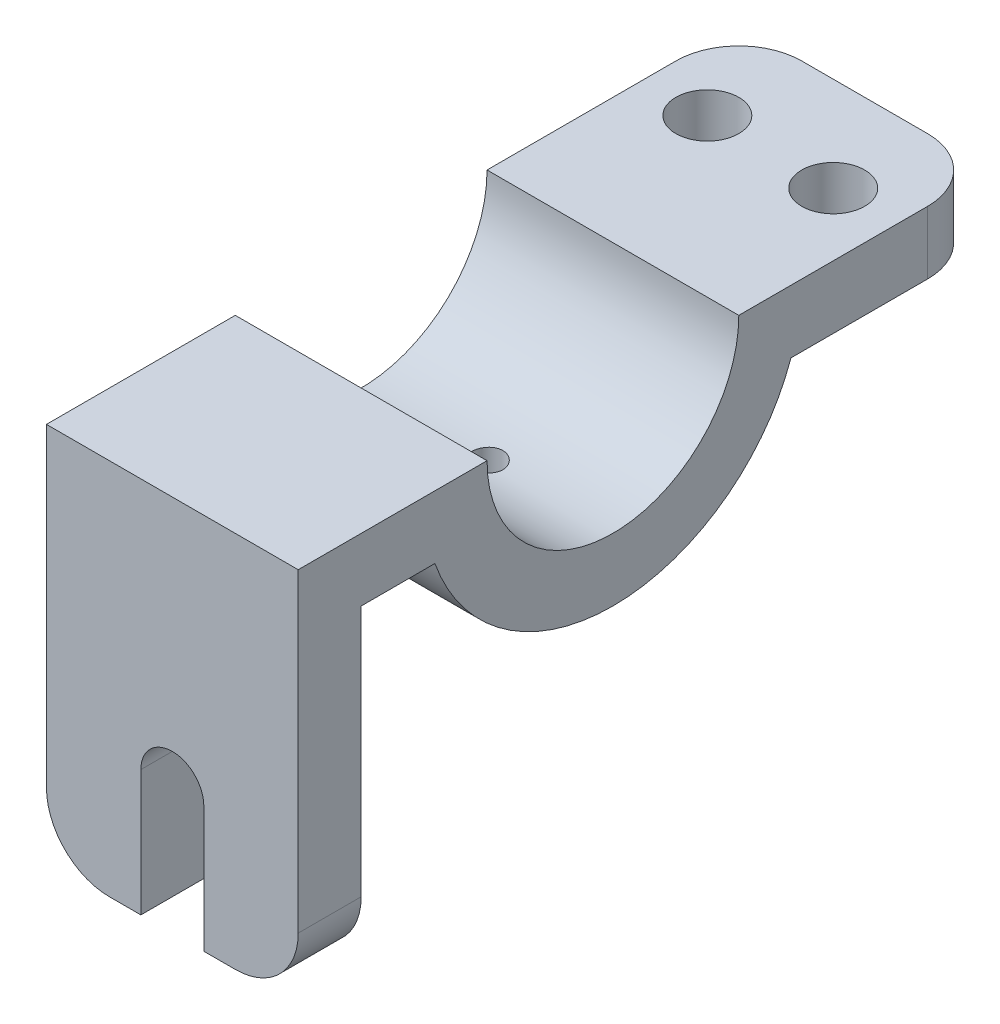
ISO-10303-21;
HEADER;
FILE_DESCRIPTION(('STEP AP214'),'2;1');
FILE_NAME('part.step','',(''),(''),'','','');
FILE_SCHEMA(('AUTOMOTIVE_DESIGN { 1 0 10303 214 1 1 1 1 }'));
ENDSEC;
DATA;
#1=APPLICATION_CONTEXT('core data for automotive mechanical design processes');
#2=APPLICATION_PROTOCOL_DEFINITION('international standard','automotive_design',2000,#1);
#3=PRODUCT_CONTEXT('',#1,'mechanical');
#4=PRODUCT('Part','Part','',(#3));
#5=PRODUCT_RELATED_PRODUCT_CATEGORY('part','',(#4));
#6=PRODUCT_DEFINITION_FORMATION('','',#4);
#7=PRODUCT_DEFINITION_CONTEXT('part definition',#1,'design');
#8=PRODUCT_DEFINITION('design','',#6,#7);
#9=PRODUCT_DEFINITION_SHAPE('','',#8);
#10=(LENGTH_UNIT() NAMED_UNIT(*) SI_UNIT(.MILLI.,.METRE.));
#11=(NAMED_UNIT(*) PLANE_ANGLE_UNIT() SI_UNIT($,.RADIAN.));
#12=(NAMED_UNIT(*) SI_UNIT($,.STERADIAN.) SOLID_ANGLE_UNIT());
#13=UNCERTAINTY_MEASURE_WITH_UNIT(LENGTH_MEASURE(1.E-05),#10,'distance_accuracy_value','');
#14=(GEOMETRIC_REPRESENTATION_CONTEXT(3) GLOBAL_UNCERTAINTY_ASSIGNED_CONTEXT((#13)) GLOBAL_UNIT_ASSIGNED_CONTEXT((#10,
#11,#12)) REPRESENTATION_CONTEXT('',''));
#15=CARTESIAN_POINT('',(0.,0.,0.));
#16=DIRECTION('',(0.,0.,1.));
#17=DIRECTION('',(1.,0.,0.));
#18=AXIS2_PLACEMENT_3D('',#15,#16,#17);
#19=CARTESIAN_POINT('',(50.8,-12.7,-139.7));
#20=DIRECTION('',(0.,0.,1.));
#21=DIRECTION('',(1.,0.,0.));
#22=AXIS2_PLACEMENT_3D('',#19,#20,#21);
#23=PLANE('',#22);
#24=DIRECTION('',(-1.,0.,0.));
#25=VECTOR('',#24,1.);
#26=CARTESIAN_POINT('',(50.8,0.,-139.7));
#27=LINE('',#26,#25);
#28=CARTESIAN_POINT('',(38.0999999999999,0.,-139.7));
#29=VERTEX_POINT('',#28);
#30=CARTESIAN_POINT('',(12.7000000000001,0.,-139.7));
#31=VERTEX_POINT('',#30);
#32=EDGE_CURVE('E220',#29,#31,#27,.T.);
#33=ORIENTED_EDGE('',*,*,#32,.F.);
#34=DIRECTION('',(0.,1.,0.));
#35=VECTOR('',#34,1.);
#36=CARTESIAN_POINT('',(38.0999999999999,-30.48,-139.7));
#37=LINE('',#36,#35);
#38=CARTESIAN_POINT('',(38.0999999999999,-12.7,-139.7));
#39=VERTEX_POINT('',#38);
#40=EDGE_CURVE('E54',#39,#29,#37,.T.);
#41=ORIENTED_EDGE('',*,*,#40,.F.);
#42=DIRECTION('',(-1.,0.,0.));
#43=VECTOR('',#42,1.);
#44=CARTESIAN_POINT('',(50.8,-12.7,-139.7));
#45=LINE('',#44,#43);
#46=CARTESIAN_POINT('',(12.7000000000001,-12.7,-139.7));
#47=VERTEX_POINT('',#46);
#48=EDGE_CURVE('E222',#39,#47,#45,.T.);
#49=ORIENTED_EDGE('',*,*,#48,.T.);
#50=DIRECTION('',(0.,1.,0.));
#51=VECTOR('',#50,1.);
#52=CARTESIAN_POINT('',(12.7000000000001,-30.48,-139.7));
#53=LINE('',#52,#51);
#54=EDGE_CURVE('E305',#47,#31,#53,.T.);
#55=ORIENTED_EDGE('',*,*,#54,.T.);
#56=EDGE_LOOP('',(#33,#41,#49,#55));
#57=FACE_BOUND('',#56,.T.);
#58=ADVANCED_FACE('F33',(#57),#23,.F.);
#59=CARTESIAN_POINT('',(50.8,-76.2,0.));
#60=DIRECTION('',(0.,1.,0.));
#61=DIRECTION('',(0.,0.,1.));
#62=AXIS2_PLACEMENT_3D('',#59,#60,#61);
#63=PLANE('',#62);
#64=DIRECTION('',(-1.,0.,0.));
#65=VECTOR('',#64,1.);
#66=CARTESIAN_POINT('',(50.8,-76.2,-12.7));
#67=LINE('',#66,#65);
#68=CARTESIAN_POINT('',(19.05,-76.2,-12.7));
#69=VERTEX_POINT('',#68);
#70=CARTESIAN_POINT('',(12.7000000000001,-76.2,-12.7));
#71=VERTEX_POINT('',#70);
#72=EDGE_CURVE('E233',#69,#71,#67,.T.);
#73=ORIENTED_EDGE('',*,*,#72,.F.);
#74=DIRECTION('',(0.,0.,1.));
#75=VECTOR('',#74,1.);
#76=CARTESIAN_POINT('',(19.05,-76.2,0.));
#77=LINE('',#76,#75);
#78=CARTESIAN_POINT('',(19.05,-76.2,0.));
#79=VERTEX_POINT('',#78);
#80=EDGE_CURVE('E47',#69,#79,#77,.T.);
#81=ORIENTED_EDGE('',*,*,#80,.T.);
#82=DIRECTION('',(-1.,0.,0.));
#83=VECTOR('',#82,1.);
#84=CARTESIAN_POINT('',(50.8,-76.2,0.));
#85=LINE('',#84,#83);
#86=CARTESIAN_POINT('',(12.7000000000001,-76.2,0.));
#87=VERTEX_POINT('',#86);
#88=EDGE_CURVE('E237',#79,#87,#85,.T.);
#89=ORIENTED_EDGE('',*,*,#88,.T.);
#90=DIRECTION('',(0.,0.,1.));
#91=VECTOR('',#90,1.);
#92=CARTESIAN_POINT('',(12.7000000000001,-76.2,-22.86));
#93=LINE('',#92,#91);
#94=EDGE_CURVE('E267',#71,#87,#93,.T.);
#95=ORIENTED_EDGE('',*,*,#94,.F.);
#96=EDGE_LOOP('',(#73,#81,#89,#95));
#97=FACE_BOUND('',#96,.T.);
#98=ADVANCED_FACE('F253',(#97),#63,.F.);
#99=CARTESIAN_POINT('',(50.8,0.,0.));
#100=DIRECTION('',(0.,0.,-1.));
#101=DIRECTION('',(0.,1.,0.));
#102=AXIS2_PLACEMENT_3D('',#99,#100,#101);
#103=PLANE('',#102);
#104=ORIENTED_EDGE('',*,*,#88,.F.);
#105=DIRECTION('',(0.,-1.,0.));
#106=VECTOR('',#105,1.);
#107=CARTESIAN_POINT('',(19.05,-76.2,0.));
#108=LINE('',#107,#106);
#109=CARTESIAN_POINT('',(19.05,-50.8,0.));
#110=VERTEX_POINT('',#109);
#111=EDGE_CURVE('E262',#110,#79,#108,.T.);
#112=ORIENTED_EDGE('',*,*,#111,.F.);
#113=CARTESIAN_POINT('',(25.4,-50.8,0.));
#114=DIRECTION('',(0.,0.,1.));
#115=DIRECTION('',(1.,0.,0.));
#116=AXIS2_PLACEMENT_3D('',#113,#114,#115);
#117=CIRCLE('',#116,6.35);
#118=CARTESIAN_POINT('',(31.75,-50.8,0.));
#119=VERTEX_POINT('',#118);
#120=EDGE_CURVE('E571',#119,#110,#117,.T.);
#121=ORIENTED_EDGE('',*,*,#120,.F.);
#122=DIRECTION('',(0.,1.,0.));
#123=VECTOR('',#122,1.);
#124=CARTESIAN_POINT('',(31.75,-50.8,0.));
#125=LINE('',#124,#123);
#126=CARTESIAN_POINT('',(31.75,-76.2,0.));
#127=VERTEX_POINT('',#126);
#128=EDGE_CURVE('E321',#127,#119,#125,.T.);
#129=ORIENTED_EDGE('',*,*,#128,.F.);
#130=CARTESIAN_POINT('',(38.0999999999999,-76.2,0.));
#131=VERTEX_POINT('',#130);
#132=EDGE_CURVE('E238',#131,#127,#85,.T.);
#133=ORIENTED_EDGE('',*,*,#132,.F.);
#134=CARTESIAN_POINT('',(38.1,-63.5,0.));
#135=DIRECTION('',(0.,0.,-1.));
#136=DIRECTION('',(1.,0.,0.));
#137=AXIS2_PLACEMENT_3D('',#134,#135,#136);
#138=CIRCLE('',#137,12.7);
#139=CARTESIAN_POINT('',(50.8,-63.4999999999999,0.));
#140=VERTEX_POINT('',#139);
#141=EDGE_CURVE('E278',#140,#131,#138,.T.);
#142=ORIENTED_EDGE('',*,*,#141,.F.);
#143=DIRECTION('',(0.,-1.,0.));
#144=VECTOR('',#143,1.);
#145=CARTESIAN_POINT('',(50.8,0.,0.));
#146=LINE('',#145,#144);
#147=CARTESIAN_POINT('',(50.8,0.,0.));
#148=VERTEX_POINT('',#147);
#149=EDGE_CURVE('E213',#148,#140,#146,.T.);
#150=ORIENTED_EDGE('',*,*,#149,.F.);
#151=DIRECTION('',(-1.,0.,0.));
#152=VECTOR('',#151,1.);
#153=CARTESIAN_POINT('',(50.8,0.,0.));
#154=LINE('',#153,#152);
#155=CARTESIAN_POINT('',(0.,0.,0.));
#156=VERTEX_POINT('',#155);
#157=EDGE_CURVE('E193',#148,#156,#154,.T.);
#158=ORIENTED_EDGE('',*,*,#157,.T.);
#159=DIRECTION('',(0.,-1.,0.));
#160=VECTOR('',#159,1.);
#161=CARTESIAN_POINT('',(0.,0.,0.));
#162=LINE('',#161,#160);
#163=CARTESIAN_POINT('',(0.,-63.4999999999999,0.));
#164=VERTEX_POINT('',#163);
#165=EDGE_CURVE('E194',#156,#164,#162,.T.);
#166=ORIENTED_EDGE('',*,*,#165,.T.);
#167=CARTESIAN_POINT('',(12.7,-63.5,0.));
#168=DIRECTION('',(0.,0.,-1.));
#169=DIRECTION('',(1.,0.,0.));
#170=AXIS2_PLACEMENT_3D('',#167,#168,#169);
#171=CIRCLE('',#170,12.7);
#172=EDGE_CURVE('E263',#87,#164,#171,.T.);
#173=ORIENTED_EDGE('',*,*,#172,.F.);
#174=EDGE_LOOP('',(#104,#112,#121,#129,#133,#142,#150,#158,#166,#173));
#175=FACE_BOUND('',#174,.T.);
#176=ADVANCED_FACE('F35',(#175),#103,.F.);
#177=CARTESIAN_POINT('',(50.8,-76.2,-12.7));
#178=DIRECTION('',(0.,0.,1.));
#179=DIRECTION('',(1.,0.,0.));
#180=AXIS2_PLACEMENT_3D('',#177,#178,#179);
#181=PLANE('',#180);
#182=CARTESIAN_POINT('',(25.4,-50.8,-12.7));
#183=DIRECTION('',(0.,0.,1.));
#184=DIRECTION('',(1.,0.,0.));
#185=AXIS2_PLACEMENT_3D('',#182,#183,#184);
#186=CIRCLE('',#185,6.35);
#187=CARTESIAN_POINT('',(31.75,-50.8,-12.7));
#188=VERTEX_POINT('',#187);
#189=CARTESIAN_POINT('',(19.05,-50.8,-12.7));
#190=VERTEX_POINT('',#189);
#191=EDGE_CURVE('E11',#188,#190,#186,.T.);
#192=ORIENTED_EDGE('',*,*,#191,.T.);
#193=DIRECTION('',(0.,-1.,0.));
#194=VECTOR('',#193,1.);
#195=CARTESIAN_POINT('',(19.05,-76.2,-12.7));
#196=LINE('',#195,#194);
#197=EDGE_CURVE('E268',#190,#69,#196,.T.);
#198=ORIENTED_EDGE('',*,*,#197,.T.);
#199=ORIENTED_EDGE('',*,*,#72,.T.);
#200=CARTESIAN_POINT('',(12.7,-63.5,-12.7));
#201=DIRECTION('',(0.,0.,1.));
#202=DIRECTION('',(1.,0.,0.));
#203=AXIS2_PLACEMENT_3D('',#200,#201,#202);
#204=CIRCLE('',#203,12.7);
#205=CARTESIAN_POINT('',(0.,-63.4999999999999,-12.7));
#206=VERTEX_POINT('',#205);
#207=EDGE_CURVE('E270',#71,#206,#204,.F.);
#208=ORIENTED_EDGE('',*,*,#207,.T.);
#209=DIRECTION('',(0.,1.,0.));
#210=VECTOR('',#209,1.);
#211=CARTESIAN_POINT('',(0.,-76.2,-12.7));
#212=LINE('',#211,#210);
#213=CARTESIAN_POINT('',(0.,-12.7,-12.7));
#214=VERTEX_POINT('',#213);
#215=EDGE_CURVE('E197',#206,#214,#212,.T.);
#216=ORIENTED_EDGE('',*,*,#215,.T.);
#217=DIRECTION('',(-1.,0.,0.));
#218=VECTOR('',#217,1.);
#219=CARTESIAN_POINT('',(50.8,-12.7,-12.7));
#220=LINE('',#219,#218);
#221=CARTESIAN_POINT('',(50.8,-12.7,-12.7));
#222=VERTEX_POINT('',#221);
#223=EDGE_CURVE('E230',#222,#214,#220,.T.);
#224=ORIENTED_EDGE('',*,*,#223,.F.);
#225=DIRECTION('',(0.,1.,0.));
#226=VECTOR('',#225,1.);
#227=CARTESIAN_POINT('',(50.8,-76.2,-12.7));
#228=LINE('',#227,#226);
#229=CARTESIAN_POINT('',(50.8,-63.5,-12.7));
#230=VERTEX_POINT('',#229);
#231=EDGE_CURVE('E287',#230,#222,#228,.T.);
#232=ORIENTED_EDGE('',*,*,#231,.F.);
#233=CARTESIAN_POINT('',(38.1,-63.5,-12.7));
#234=DIRECTION('',(0.,0.,1.));
#235=DIRECTION('',(1.,0.,0.));
#236=AXIS2_PLACEMENT_3D('',#233,#234,#235);
#237=CIRCLE('',#236,12.7);
#238=CARTESIAN_POINT('',(38.0999999999999,-76.2,-12.7));
#239=VERTEX_POINT('',#238);
#240=EDGE_CURVE('E198',#230,#239,#237,.F.);
#241=ORIENTED_EDGE('',*,*,#240,.T.);
#242=CARTESIAN_POINT('',(31.75,-76.2,-12.7));
#243=VERTEX_POINT('',#242);
#244=EDGE_CURVE('E234',#239,#243,#67,.T.);
#245=ORIENTED_EDGE('',*,*,#244,.T.);
#246=DIRECTION('',(0.,1.,0.));
#247=VECTOR('',#246,1.);
#248=CARTESIAN_POINT('',(31.75,-76.2,-12.7));
#249=LINE('',#248,#247);
#250=EDGE_CURVE('E272',#243,#188,#249,.T.);
#251=ORIENTED_EDGE('',*,*,#250,.T.);
#252=EDGE_LOOP('',(#192,#198,#199,#208,#216,#224,#232,#241,#245,#251));
#253=FACE_BOUND('',#252,.T.);
#254=ADVANCED_FACE('F361',(#253),#181,.F.);
#255=CARTESIAN_POINT('',(0.,0.,-63.5));
#256=DIRECTION('',(1.,0.,0.));
#257=DIRECTION('',(0.,0.,-1.));
#258=AXIS2_PLACEMENT_3D('',#255,#256,#257);
#259=PLANE('',#258);
#260=DIRECTION('',(0.,0.,1.));
#261=VECTOR('',#260,1.);
#262=CARTESIAN_POINT('',(0.,0.,-88.9));
#263=LINE('',#262,#261);
#264=CARTESIAN_POINT('',(0.,0.,-127.));
#265=VERTEX_POINT('',#264);
#266=CARTESIAN_POINT('',(0.,0.,-88.9));
#267=VERTEX_POINT('',#266);
#268=EDGE_CURVE('E207',#265,#267,#263,.T.);
#269=ORIENTED_EDGE('',*,*,#268,.F.);
#270=DIRECTION('',(0.,1.,0.));
#271=VECTOR('',#270,1.);
#272=CARTESIAN_POINT('',(0.,-30.48,-127.));
#273=LINE('',#272,#271);
#274=CARTESIAN_POINT('',(0.,-12.7,-127.));
#275=VERTEX_POINT('',#274);
#276=EDGE_CURVE('E62',#275,#265,#273,.T.);
#277=ORIENTED_EDGE('',*,*,#276,.F.);
#278=DIRECTION('',(0.,0.,-1.));
#279=VECTOR('',#278,1.);
#280=CARTESIAN_POINT('',(0.,-12.7,-99.4210244842766));
#281=LINE('',#280,#279);
#282=CARTESIAN_POINT('',(0.,-12.7,-99.4210244842766));
#283=VERTEX_POINT('',#282);
#284=EDGE_CURVE('E204',#283,#275,#281,.T.);
#285=ORIENTED_EDGE('',*,*,#284,.F.);
#286=CARTESIAN_POINT('',(0.,0.,-63.5));
#287=DIRECTION('',(1.,0.,0.));
#288=DIRECTION('',(0.,0.,-1.));
#289=AXIS2_PLACEMENT_3D('',#286,#287,#288);
#290=CIRCLE('',#289,38.1);
#291=CARTESIAN_POINT('',(0.,-12.7,-27.5789755157234));
#292=VERTEX_POINT('',#291);
#293=EDGE_CURVE('E202',#292,#283,#290,.T.);
#294=ORIENTED_EDGE('',*,*,#293,.F.);
#295=DIRECTION('',(0.,0.,-1.));
#296=VECTOR('',#295,1.);
#297=CARTESIAN_POINT('',(0.,-12.7,-12.7));
#298=LINE('',#297,#296);
#299=EDGE_CURVE('E200',#214,#292,#298,.T.);
#300=ORIENTED_EDGE('',*,*,#299,.F.);
#301=ORIENTED_EDGE('',*,*,#215,.F.);
#302=DIRECTION('',(0.,0.,1.));
#303=VECTOR('',#302,1.);
#304=CARTESIAN_POINT('',(0.,-63.5,-22.86));
#305=LINE('',#304,#303);
#306=EDGE_CURVE('E244',#164,#206,#305,.F.);
#307=ORIENTED_EDGE('',*,*,#306,.F.);
#308=ORIENTED_EDGE('',*,*,#165,.F.);
#309=DIRECTION('',(0.,0.,1.));
#310=VECTOR('',#309,1.);
#311=CARTESIAN_POINT('',(0.,0.,0.));
#312=LINE('',#311,#310);
#313=CARTESIAN_POINT('',(0.,0.,-38.1));
#314=VERTEX_POINT('',#313);
#315=EDGE_CURVE('E211',#314,#156,#312,.T.);
#316=ORIENTED_EDGE('',*,*,#315,.F.);
#317=CARTESIAN_POINT('',(0.,0.,-63.5));
#318=DIRECTION('',(-1.,0.,0.));
#319=DIRECTION('',(0.,0.,-1.));
#320=AXIS2_PLACEMENT_3D('',#317,#318,#319);
#321=CIRCLE('',#320,25.4);
#322=EDGE_CURVE('E209',#267,#314,#321,.T.);
#323=ORIENTED_EDGE('',*,*,#322,.F.);
#324=EDGE_LOOP('',(#269,#277,#285,#294,#300,#301,#307,#308,#316,#323));
#325=FACE_BOUND('',#324,.T.);
#326=ADVANCED_FACE('F358',(#325),#259,.F.);
#327=ORIENTED_EDGE('',*,*,#132,.T.);
#328=DIRECTION('',(0.,0.,-1.));
#329=VECTOR('',#328,1.);
#330=CARTESIAN_POINT('',(31.75,-76.2,0.));
#331=LINE('',#330,#329);
#332=EDGE_CURVE('E246',#127,#243,#331,.T.);
#333=ORIENTED_EDGE('',*,*,#332,.T.);
#334=ORIENTED_EDGE('',*,*,#244,.F.);
#335=DIRECTION('',(0.,0.,1.));
#336=VECTOR('',#335,1.);
#337=CARTESIAN_POINT('',(38.0999999999999,-76.2,-22.86));
#338=LINE('',#337,#336);
#339=EDGE_CURVE('E280',#239,#131,#338,.T.);
#340=ORIENTED_EDGE('',*,*,#339,.T.);
#341=EDGE_LOOP('',(#327,#333,#334,#340));
#342=FACE_BOUND('',#341,.T.);
#343=ADVANCED_FACE('F357',(#342),#63,.F.);
#344=CARTESIAN_POINT('',(50.8,0.,-63.5));
#345=DIRECTION('',(1.,0.,0.));
#346=DIRECTION('',(0.,0.,-1.));
#347=AXIS2_PLACEMENT_3D('',#344,#345,#346);
#348=PLANE('',#347);
#349=DIRECTION('',(0.,1.,0.));
#350=VECTOR('',#349,1.);
#351=CARTESIAN_POINT('',(50.8,-30.48,-127.));
#352=LINE('',#351,#350);
#353=CARTESIAN_POINT('',(50.8,-12.7,-127.));
#354=VERTEX_POINT('',#353);
#355=CARTESIAN_POINT('',(50.8,0.,-127.));
#356=VERTEX_POINT('',#355);
#357=EDGE_CURVE('E165',#354,#356,#352,.T.);
#358=ORIENTED_EDGE('',*,*,#357,.T.);
#359=DIRECTION('',(0.,0.,1.));
#360=VECTOR('',#359,1.);
#361=CARTESIAN_POINT('',(50.8,0.,-88.9));
#362=LINE('',#361,#360);
#363=CARTESIAN_POINT('',(50.8,0.,-88.9));
#364=VERTEX_POINT('',#363);
#365=EDGE_CURVE('E175',#356,#364,#362,.T.);
#366=ORIENTED_EDGE('',*,*,#365,.T.);
#367=CARTESIAN_POINT('',(50.8,0.,-63.5));
#368=DIRECTION('',(-1.,0.,0.));
#369=DIRECTION('',(0.,0.,-1.));
#370=AXIS2_PLACEMENT_3D('',#367,#368,#369);
#371=CIRCLE('',#370,25.4);
#372=CARTESIAN_POINT('',(50.8,0.,-38.1));
#373=VERTEX_POINT('',#372);
#374=EDGE_CURVE('E184',#364,#373,#371,.T.);
#375=ORIENTED_EDGE('',*,*,#374,.T.);
#376=DIRECTION('',(0.,0.,1.));
#377=VECTOR('',#376,1.);
#378=CARTESIAN_POINT('',(50.8,0.,0.));
#379=LINE('',#378,#377);
#380=EDGE_CURVE('E186',#373,#148,#379,.T.);
#381=ORIENTED_EDGE('',*,*,#380,.T.);
#382=ORIENTED_EDGE('',*,*,#149,.T.);
#383=DIRECTION('',(0.,0.,1.));
#384=VECTOR('',#383,1.);
#385=CARTESIAN_POINT('',(50.8,-63.5,-22.86));
#386=LINE('',#385,#384);
#387=EDGE_CURVE('E241',#140,#230,#386,.F.);
#388=ORIENTED_EDGE('',*,*,#387,.T.);
#389=ORIENTED_EDGE('',*,*,#231,.T.);
#390=DIRECTION('',(0.,0.,-1.));
#391=VECTOR('',#390,1.);
#392=CARTESIAN_POINT('',(50.8,-12.7,-12.7));
#393=LINE('',#392,#391);
#394=CARTESIAN_POINT('',(50.8,-12.7,-27.5789755157234));
#395=VERTEX_POINT('',#394);
#396=EDGE_CURVE('E289',#222,#395,#393,.T.);
#397=ORIENTED_EDGE('',*,*,#396,.T.);
#398=CARTESIAN_POINT('',(50.8,0.,-63.5));
#399=DIRECTION('',(1.,0.,0.));
#400=DIRECTION('',(0.,0.,-1.));
#401=AXIS2_PLACEMENT_3D('',#398,#399,#400);
#402=CIRCLE('',#401,38.1);
#403=CARTESIAN_POINT('',(50.8,-12.7,-99.4210244842766));
#404=VERTEX_POINT('',#403);
#405=EDGE_CURVE('E188',#395,#404,#402,.T.);
#406=ORIENTED_EDGE('',*,*,#405,.T.);
#407=DIRECTION('',(0.,0.,-1.));
#408=VECTOR('',#407,1.);
#409=CARTESIAN_POINT('',(50.8,-12.7,-99.4210244842766));
#410=LINE('',#409,#408);
#411=EDGE_CURVE('E178',#404,#354,#410,.T.);
#412=ORIENTED_EDGE('',*,*,#411,.T.);
#413=EDGE_LOOP('',(#358,#366,#375,#381,#382,#388,#389,#397,#406,#412));
#414=FACE_BOUND('',#413,.T.);
#415=ADVANCED_FACE('F174',(#414),#348,.T.);
#416=CARTESIAN_POINT('',(50.8,-12.7,-12.7));
#417=DIRECTION('',(0.,1.,0.));
#418=DIRECTION('',(0.,0.,1.));
#419=AXIS2_PLACEMENT_3D('',#416,#417,#418);
#420=PLANE('',#419);
#421=ORIENTED_EDGE('',*,*,#299,.T.);
#422=DIRECTION('',(-1.,0.,0.));
#423=VECTOR('',#422,1.);
#424=CARTESIAN_POINT('',(50.8,-12.7,-27.5789755157234));
#425=LINE('',#424,#423);
#426=EDGE_CURVE('E227',#395,#292,#425,.T.);
#427=ORIENTED_EDGE('',*,*,#426,.F.);
#428=ORIENTED_EDGE('',*,*,#396,.F.);
#429=ORIENTED_EDGE('',*,*,#223,.T.);
#430=EDGE_LOOP('',(#421,#427,#428,#429));
#431=FACE_BOUND('',#430,.T.);
#432=ADVANCED_FACE('F356',(#431),#420,.F.);
#433=CARTESIAN_POINT('',(50.8,0.,-63.5));
#434=DIRECTION('',(-1.,0.,0.));
#435=DIRECTION('',(0.,0.,1.));
#436=AXIS2_PLACEMENT_3D('',#433,#434,#435);
#437=CYLINDRICAL_SURFACE('',#436,38.1);
#438=CARTESIAN_POINT('',(25.4,-37.9674778593469,-60.325));
#439=CARTESIAN_POINT('',(25.5780086254139,-37.9674796148514,-60.325007776114));
#440=CARTESIAN_POINT('',(25.7561384360648,-37.9687432124492,-60.3400206330301));
#441=CARTESIAN_POINT('',(26.1074694396037,-37.9736610260083,-60.3996887664415));
#442=CARTESIAN_POINT('',(26.2806648157828,-37.9773179506743,-60.444377630302));
#443=CARTESIAN_POINT('',(26.6169876476932,-37.9866053672742,-60.5620963484574));
#444=CARTESIAN_POINT('',(26.7801207505307,-37.9922347401668,-60.6351101355075));
#445=CARTESIAN_POINT('',(27.0917771447927,-38.0048313657024,-60.8073775325589));
#446=CARTESIAN_POINT('',(27.2403035503201,-38.0117983322355,-60.9066255327948));
#447=CARTESIAN_POINT('',(27.5189505597363,-38.0263052267685,-61.1288193967457));
#448=CARTESIAN_POINT('',(27.6490284961648,-38.033846422922,-61.251818690549));
#449=CARTESIAN_POINT('',(27.8867195828058,-38.0486404573867,-61.5179106168534));
#450=CARTESIAN_POINT('',(27.9943317515331,-38.0558932830884,-61.6610041267746));
#451=CARTESIAN_POINT('',(28.1841785015334,-38.0693053861151,-61.9634770211446));
#452=CARTESIAN_POINT('',(28.2663761671011,-38.0754630672337,-62.1228796525004));
#453=CARTESIAN_POINT('',(28.4028244843012,-38.0859774147697,-62.4532837784164));
#454=CARTESIAN_POINT('',(28.4570756250993,-38.0903341127107,-62.6242850698987));
#455=CARTESIAN_POINT('',(28.5359680862429,-38.0967467506223,-62.9726077478657));
#456=CARTESIAN_POINT('',(28.5606784358042,-38.0988080535635,-63.1499133994624));
#457=CARTESIAN_POINT('',(28.5800012701111,-38.1004158213116,-63.5061667450002));
#458=CARTESIAN_POINT('',(28.5746143145569,-38.0999623328846,-63.6851144083441));
#459=CARTESIAN_POINT('',(28.5339519103305,-38.0965960392816,-64.0391040510722));
#460=CARTESIAN_POINT('',(28.4987506928717,-38.0936893421403,-64.2141546234801));
#461=CARTESIAN_POINT('',(28.3995744206954,-38.0857505953842,-64.5558540796778));
#462=CARTESIAN_POINT('',(28.3355990922059,-38.0807185255475,-64.722502883512));
#463=CARTESIAN_POINT('',(28.1806078908985,-38.0690846412153,-65.042904460022));
#464=CARTESIAN_POINT('',(28.0895587731489,-38.0624808988053,-65.1966410779422));
#465=CARTESIAN_POINT('',(27.8830286839879,-38.0484457872987,-65.4866779414106));
#466=CARTESIAN_POINT('',(27.7675472169992,-38.0410144014161,-65.6229778331883));
#467=CARTESIAN_POINT('',(27.5150121531421,-38.0261325057258,-65.8747062131825));
#468=CARTESIAN_POINT('',(27.3778940540503,-38.0186820064471,-65.9900700029115));
#469=CARTESIAN_POINT('',(27.0862027962557,-38.004624326273,-66.1961515765796));
#470=CARTESIAN_POINT('',(26.9316296231641,-37.9980171460728,-66.2868693402021));
#471=CARTESIAN_POINT('',(26.6093705563245,-37.9863929785793,-66.4410812545836));
#472=CARTESIAN_POINT('',(26.4416830482436,-37.9813761874431,-66.5045720475327));
#473=CARTESIAN_POINT('',(26.0979770201881,-37.9735046116394,-66.6024798473155));
#474=CARTESIAN_POINT('',(25.9219586754424,-37.9706497815191,-66.636897465381));
#475=CARTESIAN_POINT('',(25.5671536326869,-37.967432729465,-66.6756000207476));
#476=CARTESIAN_POINT('',(25.3883768411061,-37.9670630442666,-66.6799751809243));
#477=CARTESIAN_POINT('',(25.0326323589124,-37.9688384390387,-66.6587049635173));
#478=CARTESIAN_POINT('',(24.855664651441,-37.9709834955532,-66.6330598659443));
#479=CARTESIAN_POINT('',(24.5088208203364,-37.9775398735957,-66.5525523189449));
#480=CARTESIAN_POINT('',(24.3389348565672,-37.981947928906,-66.4977319743915));
#481=CARTESIAN_POINT('',(24.0107721391301,-37.9925309166027,-66.3604728865797));
#482=CARTESIAN_POINT('',(23.852495571789,-37.9987058773396,-66.2780337001669));
#483=CARTESIAN_POINT('',(23.5516316742038,-38.0121450024561,-66.0876487743331));
#484=CARTESIAN_POINT('',(23.409082504835,-38.0194117192607,-65.97964291245));
#485=CARTESIAN_POINT('',(23.1441055376208,-38.0342069443175,-65.7412773577192));
#486=CARTESIAN_POINT('',(23.0216780860846,-38.0417354570727,-65.6109172802184));
#487=CARTESIAN_POINT('',(22.8001118616801,-38.0562282152053,-65.3311538589948));
#488=CARTESIAN_POINT('',(22.7010317092151,-38.0631910120889,-65.1817040039012));
#489=CARTESIAN_POINT('',(22.5293748244326,-38.0757469329061,-64.8682351134557));
#490=CARTESIAN_POINT('',(22.4567978272698,-38.0813400705264,-64.7042162237121));
#491=CARTESIAN_POINT('',(22.340308118329,-38.0905198062144,-64.3664752125853));
#492=CARTESIAN_POINT('',(22.296359156412,-38.0941089410165,-64.1927656659029));
#493=CARTESIAN_POINT('',(22.2382545907308,-38.0988865697221,-63.8404018435355));
#494=CARTESIAN_POINT('',(22.2240984230262,-38.1000751090659,-63.6617476615111));
#495=CARTESIAN_POINT('',(22.2259878682331,-38.0999176999798,-63.305143746343));
#496=CARTESIAN_POINT('',(22.2419421233374,-38.0985794181538,-63.1271935186288));
#497=CARTESIAN_POINT('',(22.3034090205741,-38.0935339028085,-62.7765092192052));
#498=CARTESIAN_POINT('',(22.3489217028537,-38.0898266660717,-62.6037751545809));
#499=CARTESIAN_POINT('',(22.4681903001385,-38.0804591990999,-62.2684205275252));
#500=CARTESIAN_POINT('',(22.5419445740184,-38.0747990823492,-62.1057993780682));
#501=CARTESIAN_POINT('',(22.7155922541377,-38.0621590787551,-61.7952327310456));
#502=CARTESIAN_POINT('',(22.8154852470154,-38.055179212783,-61.6472870014518));
#503=CARTESIAN_POINT('',(23.0389176471459,-38.0406579324267,-61.3698033160742));
#504=CARTESIAN_POINT('',(23.1625246532253,-38.0331149513177,-61.2403198737488));
#505=CARTESIAN_POINT('',(23.4297542857049,-38.0183309031221,-61.0038854006734));
#506=CARTESIAN_POINT('',(23.5733817523132,-38.0110899095966,-60.8969398345019));
#507=CARTESIAN_POINT('',(23.8768540772255,-37.9977149749742,-60.7084721217421));
#508=CARTESIAN_POINT('',(24.036728818754,-37.9915831336505,-60.6269979880194));
#509=CARTESIAN_POINT('',(24.3678311116323,-37.981146402472,-60.4921545395352));
#510=CARTESIAN_POINT('',(24.5390453541745,-37.9768394132918,-60.4387529127989));
#511=CARTESIAN_POINT('',(24.8260580574215,-37.9716477099589,-60.3751710388307));
#512=CARTESIAN_POINT('',(24.9400106125723,-37.9700912043147,-60.3563819093645));
#513=CARTESIAN_POINT('',(25.1692918100798,-37.9680057114582,-60.3312938866163));
#514=CARTESIAN_POINT('',(25.2846204487376,-37.9674767214846,-60.3249949597693));
#515=CARTESIAN_POINT('',(25.4,-37.9674778593469,-60.325));
#516=B_SPLINE_CURVE_WITH_KNOTS('',3,(#438,#439,#440,#441,#442,#443,#444,#445,#446,#447,#448,
#449,#450,#451,#452,#453,#454,#455,#456,#457,#458,#459,#460,#461,#462,#463,#464,#465,#466,#467,
#468,#469,#470,#471,#472,#473,#474,#475,#476,#477,#478,#479,#480,#481,#482,#483,#484,#485,#486,
#487,#488,#489,#490,#491,#492,#493,#494,#495,#496,#497,#498,#499,#500,#501,#502,#503,#504,#505,
#506,#507,#508,#509,#510,#511,#512,#513,#514,#515),.UNSPECIFIED.,.T.,.F.,(4,2,2,2,2,2,2,2,2,2,2,
2,2,2,2,2,2,2,2,2,2,2,2,2,2,2,2,2,2,2,2,2,2,2,2,2,2,2,4),(0.,0.533604603517509,1.06781417349037,
1.60172115641094,2.13551406411709,2.67052206526966,3.20555343497891,3.74135834978335,
4.2771538857373,4.81169494296256,5.34622605970216,5.87943020597205,6.41263942553357,
6.94650611589526,7.4803836360617,8.01588389273743,8.55138459084428,9.08695131145286,
9.62250677207597,10.1564531576629,10.6903945629632,11.2235674807547,11.7567489539102,
12.2911969327788,12.8256541089181,13.3614392326626,13.8972190021753,14.4323190169852,
14.9674089029308,15.5008778862257,16.0343475940937,16.5677863066157,17.1012165837663,
17.6361906712906,18.1712943208452,18.7074006261176,19.2428885044878,19.5887550320896,
19.9346206302438),.UNSPECIFIED.);
#517=CARTESIAN_POINT('',(25.4,-37.9674778593469,-60.325));
#518=VERTEX_POINT('',#517);
#519=EDGE_CURVE('E314',#518,#518,#516,.T.);
#520=ORIENTED_EDGE('',*,*,#519,.T.);
#521=EDGE_LOOP('',(#520));
#522=FACE_BOUND('',#521,.T.);
#523=ORIENTED_EDGE('',*,*,#293,.T.);
#524=DIRECTION('',(-1.,0.,0.));
#525=VECTOR('',#524,1.);
#526=CARTESIAN_POINT('',(50.8,-12.7,-99.4210244842766));
#527=LINE('',#526,#525);
#528=EDGE_CURVE('E224',#404,#283,#527,.T.);
#529=ORIENTED_EDGE('',*,*,#528,.F.);
#530=ORIENTED_EDGE('',*,*,#405,.F.);
#531=ORIENTED_EDGE('',*,*,#426,.T.);
#532=EDGE_LOOP('',(#523,#529,#530,#531));
#533=FACE_BOUND('',#532,.T.);
#534=ADVANCED_FACE('F295',(#522,#533),#437,.T.);
#535=CARTESIAN_POINT('',(50.8,-12.7,-99.4210244842766));
#536=DIRECTION('',(0.,1.,0.));
#537=DIRECTION('',(0.,0.,1.));
#538=AXIS2_PLACEMENT_3D('',#535,#536,#537);
#539=PLANE('',#538);
#540=CARTESIAN_POINT('',(38.1,-12.7,-120.65));
#541=DIRECTION('',(0.,1.,0.));
#542=DIRECTION('',(0.,0.,1.));
#543=AXIS2_PLACEMENT_3D('',#540,#541,#542);
#544=CIRCLE('',#543,6.35);
#545=CARTESIAN_POINT('',(38.1,-12.7,-114.3));
#546=VERTEX_POINT('',#545);
#547=EDGE_CURVE('E170',#546,#546,#544,.T.);
#548=ORIENTED_EDGE('',*,*,#547,.T.);
#549=EDGE_LOOP('',(#548));
#550=FACE_BOUND('',#549,.T.);
#551=CARTESIAN_POINT('',(12.7,-12.7,-120.65));
#552=DIRECTION('',(0.,1.,0.));
#553=DIRECTION('',(0.,0.,1.));
#554=AXIS2_PLACEMENT_3D('',#551,#552,#553);
#555=CIRCLE('',#554,6.35);
#556=CARTESIAN_POINT('',(12.7,-12.7,-114.3));
#557=VERTEX_POINT('',#556);
#558=EDGE_CURVE('E386',#557,#557,#555,.T.);
#559=ORIENTED_EDGE('',*,*,#558,.T.);
#560=EDGE_LOOP('',(#559));
#561=FACE_BOUND('',#560,.T.);
#562=ORIENTED_EDGE('',*,*,#48,.F.);
#563=CARTESIAN_POINT('',(38.1,-12.7,-127.));
#564=DIRECTION('',(0.,1.,0.));
#565=DIRECTION('',(0.,0.,1.));
#566=AXIS2_PLACEMENT_3D('',#563,#564,#565);
#567=CIRCLE('',#566,12.7);
#568=EDGE_CURVE('E301',#39,#354,#567,.F.);
#569=ORIENTED_EDGE('',*,*,#568,.T.);
#570=ORIENTED_EDGE('',*,*,#411,.F.);
#571=ORIENTED_EDGE('',*,*,#528,.T.);
#572=ORIENTED_EDGE('',*,*,#284,.T.);
#573=CARTESIAN_POINT('',(12.7,-12.7,-127.));
#574=DIRECTION('',(0.,1.,0.));
#575=DIRECTION('',(0.,0.,1.));
#576=AXIS2_PLACEMENT_3D('',#573,#574,#575);
#577=CIRCLE('',#576,12.7);
#578=EDGE_CURVE('E310',#275,#47,#577,.F.);
#579=ORIENTED_EDGE('',*,*,#578,.T.);
#580=EDGE_LOOP('',(#562,#569,#570,#571,#572,#579));
#581=FACE_BOUND('',#580,.T.);
#582=ADVANCED_FACE('F300',(#550,#561,#581),#539,.F.);
#583=CARTESIAN_POINT('',(50.8,0.,-88.9));
#584=DIRECTION('',(0.,-1.,0.));
#585=DIRECTION('',(0.,0.,-1.));
#586=AXIS2_PLACEMENT_3D('',#583,#584,#585);
#587=PLANE('',#586);
#588=CARTESIAN_POINT('',(38.1,0.,-120.65));
#589=DIRECTION('',(0.,1.,0.));
#590=DIRECTION('',(0.,0.,1.));
#591=AXIS2_PLACEMENT_3D('',#588,#589,#590);
#592=CIRCLE('',#591,6.35);
#593=CARTESIAN_POINT('',(38.1,0.,-114.3));
#594=VERTEX_POINT('',#593);
#595=EDGE_CURVE('E388',#594,#594,#592,.T.);
#596=ORIENTED_EDGE('',*,*,#595,.F.);
#597=EDGE_LOOP('',(#596));
#598=FACE_BOUND('',#597,.T.);
#599=CARTESIAN_POINT('',(12.7,0.,-120.65));
#600=DIRECTION('',(0.,1.,0.));
#601=DIRECTION('',(0.,0.,1.));
#602=AXIS2_PLACEMENT_3D('',#599,#600,#601);
#603=CIRCLE('',#602,6.35);
#604=CARTESIAN_POINT('',(12.7,0.,-114.3));
#605=VERTEX_POINT('',#604);
#606=EDGE_CURVE('E392',#605,#605,#603,.T.);
#607=ORIENTED_EDGE('',*,*,#606,.F.);
#608=EDGE_LOOP('',(#607));
#609=FACE_BOUND('',#608,.T.);
#610=ORIENTED_EDGE('',*,*,#365,.F.);
#611=CARTESIAN_POINT('',(38.1,0.,-127.));
#612=DIRECTION('',(0.,-1.,0.));
#613=DIRECTION('',(0.,0.,-1.));
#614=AXIS2_PLACEMENT_3D('',#611,#612,#613);
#615=CIRCLE('',#614,12.7);
#616=EDGE_CURVE('E162',#29,#356,#615,.T.);
#617=ORIENTED_EDGE('',*,*,#616,.F.);
#618=ORIENTED_EDGE('',*,*,#32,.T.);
#619=CARTESIAN_POINT('',(12.7,0.,-127.));
#620=DIRECTION('',(0.,-1.,0.));
#621=DIRECTION('',(0.,0.,1.));
#622=AXIS2_PLACEMENT_3D('',#619,#620,#621);
#623=CIRCLE('',#622,12.7);
#624=EDGE_CURVE('E303',#265,#31,#623,.T.);
#625=ORIENTED_EDGE('',*,*,#624,.F.);
#626=ORIENTED_EDGE('',*,*,#268,.T.);
#627=DIRECTION('',(-1.,0.,0.));
#628=VECTOR('',#627,1.);
#629=CARTESIAN_POINT('',(50.8,0.,-88.9));
#630=LINE('',#629,#628);
#631=EDGE_CURVE('E182',#364,#267,#630,.T.);
#632=ORIENTED_EDGE('',*,*,#631,.F.);
#633=EDGE_LOOP('',(#610,#617,#618,#625,#626,#632));
#634=FACE_BOUND('',#633,.T.);
#635=ADVANCED_FACE('F180',(#598,#609,#634),#587,.F.);
#636=CARTESIAN_POINT('',(50.8,0.,-63.5));
#637=DIRECTION('',(-1.,0.,0.));
#638=DIRECTION('',(0.,0.,1.));
#639=AXIS2_PLACEMENT_3D('',#636,#637,#638);
#640=CYLINDRICAL_SURFACE('',#639,25.4);
#641=CARTESIAN_POINT('',(25.4,-25.2007812378902,-60.325));
#642=CARTESIAN_POINT('',(25.2224079195734,-25.2007837886635,-60.3250075503616));
#643=CARTESIAN_POINT('',(25.0447048445381,-25.2026787664858,-60.3399505682489));
#644=CARTESIAN_POINT('',(24.6942442037058,-25.2100510638639,-60.3993249545798));
#645=CARTESIAN_POINT('',(24.5214920027627,-25.2155321267418,-60.4437871372147));
#646=CARTESIAN_POINT('',(24.1860579497233,-25.2294462873713,-60.5608686001088));
#647=CARTESIAN_POINT('',(24.0233693495122,-25.2378773811748,-60.6334687699056));
#648=CARTESIAN_POINT('',(23.7125148661818,-25.2567392185894,-60.8047244679951));
#649=CARTESIAN_POINT('',(23.5643465062855,-25.2671696202699,-60.9033755420342));
#650=CARTESIAN_POINT('',(23.2858789461557,-25.2889202024282,-61.124524118164));
#651=CARTESIAN_POINT('',(23.1556727610552,-25.3002445696242,-61.2471383449191));
#652=CARTESIAN_POINT('',(22.9176290834472,-25.3224694575149,-61.5124814189476));
#653=CARTESIAN_POINT('',(22.8097927037997,-25.333369957101,-61.6552112663463));
#654=CARTESIAN_POINT('',(22.619216154027,-25.3535617465851,-61.9573185150415));
#655=CARTESIAN_POINT('',(22.5365601527234,-25.362847595855,-62.1167494066374));
#656=CARTESIAN_POINT('',(22.399229776075,-25.3787178093219,-62.447364668069));
#657=CARTESIAN_POINT('',(22.3445543622033,-25.3853022737815,-62.6185486014117));
#658=CARTESIAN_POINT('',(22.2650150732153,-25.3949983425693,-62.9668594765561));
#659=CARTESIAN_POINT('',(22.2399965682747,-25.3981279544165,-63.1439505982275));
#660=CARTESIAN_POINT('',(22.2200020610036,-25.400623185561,-63.4998435351281));
#661=CARTESIAN_POINT('',(22.2250248768203,-25.3999889529314,-63.6786452827834));
#662=CARTESIAN_POINT('',(22.2648465075019,-25.3950425266791,-64.0318318915977));
#663=CARTESIAN_POINT('',(22.2994790210713,-25.3907508751877,-64.2062358313208));
#664=CARTESIAN_POINT('',(22.39727699432,-25.3789949104676,-64.5467367481598));
#665=CARTESIAN_POINT('',(22.4604429964319,-25.3715305369244,-64.7128335672874));
#666=CARTESIAN_POINT('',(22.6136917458354,-25.3542324741605,-65.0325201956071));
#667=CARTESIAN_POINT('',(22.7038464613173,-25.3443924638091,-65.1860751493574));
#668=CARTESIAN_POINT('',(22.9084611200144,-25.3234440071291,-65.4759389644292));
#669=CARTESIAN_POINT('',(23.0229221779251,-25.3123355026377,-65.612247034346));
#670=CARTESIAN_POINT('',(23.2738318096199,-25.2900036175486,-65.8647247990816));
#671=CARTESIAN_POINT('',(23.4104253146243,-25.27877997072,-65.9807504867949));
#672=CARTESIAN_POINT('',(23.7012245771137,-25.2575577136454,-66.1882507202939));
#673=CARTESIAN_POINT('',(23.8554303898033,-25.2475591072393,-66.2797251891226));
#674=CARTESIAN_POINT('',(24.1772052593642,-25.2299190931815,-66.4355346084501));
#675=CARTESIAN_POINT('',(24.3447799615406,-25.2222786880333,-66.4998580209252));
#676=CARTESIAN_POINT('',(24.6884691059791,-25.2102396796987,-66.5994117011745));
#677=CARTESIAN_POINT('',(24.8645831362521,-25.2058409202811,-66.6346433710355));
#678=CARTESIAN_POINT('',(25.2190798411397,-25.2008117875574,-66.6748227485239));
#679=CARTESIAN_POINT('',(25.3974392013228,-25.2001561965182,-66.6799731193378));
#680=CARTESIAN_POINT('',(25.7524782506751,-25.2026209322195,-66.6603784306028));
#681=CARTESIAN_POINT('',(25.9291579755647,-25.2057411784784,-66.6356340082594));
#682=CARTESIAN_POINT('',(26.2752151197439,-25.2153830017466,-66.5571227729631));
#683=CARTESIAN_POINT('',(26.4446151512918,-25.2218930752222,-66.5034540943575));
#684=CARTESIAN_POINT('',(26.7720116766635,-25.2375716986293,-66.3687188232775));
#685=CARTESIAN_POINT('',(26.9300077695959,-25.2467403419627,-66.2876512681982));
#686=CARTESIAN_POINT('',(27.2310283976425,-25.2667634281861,-66.0999211681367));
#687=CARTESIAN_POINT('',(27.3739694649493,-25.2776265177609,-65.9931257218629));
#688=CARTESIAN_POINT('',(27.6399708234975,-25.299787342298,-65.7571592428086));
#689=CARTESIAN_POINT('',(27.7630303410723,-25.3110850941534,-65.6279873396804));
#690=CARTESIAN_POINT('',(27.9864873179147,-25.3329197263244,-65.3500493549593));
#691=CARTESIAN_POINT('',(28.0867516074296,-25.343451902689,-65.2011757849886));
#692=CARTESIAN_POINT('',(28.2608505363949,-25.3624983355015,-64.8885831787359));
#693=CARTESIAN_POINT('',(28.3346857085708,-25.371012632622,-64.7248644417678));
#694=CARTESIAN_POINT('',(28.4536105893732,-25.3850430912955,-64.3876714011071));
#695=CARTESIAN_POINT('',(28.4987772619602,-25.3905672742338,-64.2142245894699));
#696=CARTESIAN_POINT('',(28.559333393318,-25.3980283844051,-63.862135492743));
#697=CARTESIAN_POINT('',(28.574724194861,-25.3999654734014,-63.6834934423064));
#698=CARTESIAN_POINT('',(28.575266601311,-25.4000333757734,-63.3273851771534));
#699=CARTESIAN_POINT('',(28.5606235499213,-25.3981900362311,-63.1499192451023));
#700=CARTESIAN_POINT('',(28.5019488209428,-25.3909555827063,-62.7999915683552));
#701=CARTESIAN_POINT('',(28.457917163793,-25.3855644711913,-62.6275298201789));
#702=CARTESIAN_POINT('',(28.341779594776,-25.371837562191,-62.2925329674061));
#703=CARTESIAN_POINT('',(28.2696835171963,-25.363502796311,-62.1299944085975));
#704=CARTESIAN_POINT('',(28.0994849304481,-25.3448114846066,-61.819290461827));
#705=CARTESIAN_POINT('',(28.0013821121065,-25.3344549147471,-61.6711252447667));
#706=CARTESIAN_POINT('',(27.7811951165239,-25.3127915628292,-61.3923248046881));
#707=CARTESIAN_POINT('',(27.6589581522291,-25.3014790041464,-61.2618106894524));
#708=CARTESIAN_POINT('',(27.3942899610792,-25.2792250195679,-61.0230667790975));
#709=CARTESIAN_POINT('',(27.251853957571,-25.2682836822188,-60.914842269895));
#710=CARTESIAN_POINT('',(26.9502001981875,-25.247965904353,-60.7233923420104));
#711=CARTESIAN_POINT('',(26.7909197608357,-25.2385956701102,-60.6402650754028));
#712=CARTESIAN_POINT('',(26.4606319394983,-25.2225537968289,-60.5020566838283));
#713=CARTESIAN_POINT('',(26.2896375408987,-25.2158792243995,-60.4469450555456));
#714=CARTESIAN_POINT('',(25.9981319164475,-25.2076049927833,-60.3795263117746));
#715=CARTESIAN_POINT('',(25.8794593515445,-25.2050588293182,-60.3591083506159));
#716=CARTESIAN_POINT('',(25.6405414925448,-25.20164609433,-60.3318426890007));
#717=CARTESIAN_POINT('',(25.5202962103876,-25.2007795100634,-60.3249948855834));
#718=CARTESIAN_POINT('',(25.4,-25.2007812378902,-60.325));
#719=B_SPLINE_CURVE_WITH_KNOTS('',3,(#641,#642,#643,#644,#645,#646,#647,#648,#649,#650,#651,
#652,#653,#654,#655,#656,#657,#658,#659,#660,#661,#662,#663,#664,#665,#666,#667,#668,#669,#670,
#671,#672,#673,#674,#675,#676,#677,#678,#679,#680,#681,#682,#683,#684,#685,#686,#687,#688,#689,
#690,#691,#692,#693,#694,#695,#696,#697,#698,#699,#700,#701,#702,#703,#704,#705,#706,#707,#708,
#709,#710,#711,#712,#713,#714,#715,#716,#717,#718),.UNSPECIFIED.,.T.,.F.,(4,2,2,2,2,2,2,2,2,2,2,
2,2,2,2,2,2,2,2,2,2,2,2,2,2,2,2,2,2,2,2,2,2,2,2,2,2,2,4),(0.,0.532336778214407,1.06523012274417,
1.59776217480876,2.13020323200343,2.66530553490378,3.2004344518614,3.73733296408156,
4.27421154734649,4.80827838118715,5.34232420449102,5.87339014468022,6.40446618106236,
6.93697119607324,7.46950063718826,8.00566975672832,8.54184055689735,9.07823897761606,
9.61461154491424,10.1473662661654,10.680109631985,11.2110567789484,11.7420225816212,
12.2757923082409,12.8095828008647,13.3464158508634,13.8832380794334,14.4186129811994,
14.9539637391454,15.4856664668915,16.0173688248529,16.5488850320406,17.0804075582766,
17.6154096369443,18.1505384441165,18.6877337408907,19.2243428820214,19.5849365683882,
19.9455275188143),.UNSPECIFIED.);
#720=CARTESIAN_POINT('',(25.4,-25.2007812378902,-60.325));
#721=VERTEX_POINT('',#720);
#722=EDGE_CURVE('E37',#721,#721,#719,.T.);
#723=ORIENTED_EDGE('',*,*,#722,.T.);
#724=EDGE_LOOP('',(#723));
#725=FACE_BOUND('',#724,.T.);
#726=ORIENTED_EDGE('',*,*,#322,.T.);
#727=DIRECTION('',(-1.,0.,0.));
#728=VECTOR('',#727,1.);
#729=CARTESIAN_POINT('',(50.8,0.,-38.1));
#730=LINE('',#729,#728);
#731=EDGE_CURVE('E216',#373,#314,#730,.T.);
#732=ORIENTED_EDGE('',*,*,#731,.F.);
#733=ORIENTED_EDGE('',*,*,#374,.F.);
#734=ORIENTED_EDGE('',*,*,#631,.T.);
#735=EDGE_LOOP('',(#726,#732,#733,#734));
#736=FACE_BOUND('',#735,.T.);
#737=ADVANCED_FACE('F364',(#725,#736),#640,.F.);
#738=CARTESIAN_POINT('',(50.8,0.,0.));
#739=DIRECTION('',(0.,-1.,0.));
#740=DIRECTION('',(0.,0.,-1.));
#741=AXIS2_PLACEMENT_3D('',#738,#739,#740);
#742=PLANE('',#741);
#743=ORIENTED_EDGE('',*,*,#315,.T.);
#744=ORIENTED_EDGE('',*,*,#157,.F.);
#745=ORIENTED_EDGE('',*,*,#380,.F.);
#746=ORIENTED_EDGE('',*,*,#731,.T.);
#747=EDGE_LOOP('',(#743,#744,#745,#746));
#748=FACE_BOUND('',#747,.T.);
#749=ADVANCED_FACE('F352',(#748),#742,.F.);
#750=CARTESIAN_POINT('',(38.1,-63.5,-22.86));
#751=DIRECTION('',(0.,0.,1.));
#752=DIRECTION('',(1.,0.,0.));
#753=AXIS2_PLACEMENT_3D('',#750,#751,#752);
#754=CYLINDRICAL_SURFACE('',#753,12.7);
#755=ORIENTED_EDGE('',*,*,#387,.F.);
#756=ORIENTED_EDGE('',*,*,#141,.T.);
#757=ORIENTED_EDGE('',*,*,#339,.F.);
#758=ORIENTED_EDGE('',*,*,#240,.F.);
#759=EDGE_LOOP('',(#755,#756,#757,#758));
#760=FACE_BOUND('',#759,.T.);
#761=ADVANCED_FACE('F349',(#760),#754,.T.);
#762=CARTESIAN_POINT('',(12.7,-63.5,-22.86));
#763=DIRECTION('',(0.,0.,1.));
#764=DIRECTION('',(1.,0.,0.));
#765=AXIS2_PLACEMENT_3D('',#762,#763,#764);
#766=CYLINDRICAL_SURFACE('',#765,12.7);
#767=ORIENTED_EDGE('',*,*,#94,.T.);
#768=ORIENTED_EDGE('',*,*,#172,.T.);
#769=ORIENTED_EDGE('',*,*,#306,.T.);
#770=ORIENTED_EDGE('',*,*,#207,.F.);
#771=EDGE_LOOP('',(#767,#768,#769,#770));
#772=FACE_BOUND('',#771,.T.);
#773=ADVANCED_FACE('F342',(#772),#766,.T.);
#774=CARTESIAN_POINT('',(25.4,-50.8,-22.86));
#775=DIRECTION('',(0.,0.,1.));
#776=DIRECTION('',(1.,0.,0.));
#777=AXIS2_PLACEMENT_3D('',#774,#775,#776);
#778=CYLINDRICAL_SURFACE('',#777,6.35);
#779=DIRECTION('',(0.,0.,1.));
#780=VECTOR('',#779,1.);
#781=CARTESIAN_POINT('',(31.75,-50.8,-22.86));
#782=LINE('',#781,#780);
#783=EDGE_CURVE('E572',#188,#119,#782,.T.);
#784=ORIENTED_EDGE('',*,*,#783,.T.);
#785=ORIENTED_EDGE('',*,*,#120,.T.);
#786=DIRECTION('',(0.,0.,1.));
#787=VECTOR('',#786,1.);
#788=CARTESIAN_POINT('',(19.05,-50.8,-22.86));
#789=LINE('',#788,#787);
#790=EDGE_CURVE('E568',#190,#110,#789,.T.);
#791=ORIENTED_EDGE('',*,*,#790,.F.);
#792=ORIENTED_EDGE('',*,*,#191,.F.);
#793=EDGE_LOOP('',(#784,#785,#791,#792));
#794=FACE_BOUND('',#793,.T.);
#795=ADVANCED_FACE('F339',(#794),#778,.F.);
#796=CARTESIAN_POINT('',(19.05,-76.2,-22.86));
#797=DIRECTION('',(-1.,0.,0.));
#798=DIRECTION('',(0.,-1.,0.));
#799=AXIS2_PLACEMENT_3D('',#796,#797,#798);
#800=PLANE('',#799);
#801=ORIENTED_EDGE('',*,*,#790,.T.);
#802=ORIENTED_EDGE('',*,*,#111,.T.);
#803=ORIENTED_EDGE('',*,*,#80,.F.);
#804=ORIENTED_EDGE('',*,*,#197,.F.);
#805=EDGE_LOOP('',(#801,#802,#803,#804));
#806=FACE_BOUND('',#805,.T.);
#807=ADVANCED_FACE('F335',(#806),#800,.F.);
#808=CARTESIAN_POINT('',(31.75,-50.8,-22.86));
#809=DIRECTION('',(1.,0.,0.));
#810=DIRECTION('',(0.,0.,-1.));
#811=AXIS2_PLACEMENT_3D('',#808,#809,#810);
#812=PLANE('',#811);
#813=ORIENTED_EDGE('',*,*,#332,.F.);
#814=ORIENTED_EDGE('',*,*,#128,.T.);
#815=ORIENTED_EDGE('',*,*,#783,.F.);
#816=ORIENTED_EDGE('',*,*,#250,.F.);
#817=EDGE_LOOP('',(#813,#814,#815,#816));
#818=FACE_BOUND('',#817,.T.);
#819=ADVANCED_FACE('F332',(#818),#812,.F.);
#820=CARTESIAN_POINT('',(25.4,-60.96,-63.5));
#821=DIRECTION('',(0.,1.,0.));
#822=DIRECTION('',(0.,0.,1.));
#823=AXIS2_PLACEMENT_3D('',#820,#821,#822);
#824=CYLINDRICAL_SURFACE('',#823,3.175);
#825=ORIENTED_EDGE('',*,*,#722,.F.);
#826=EDGE_LOOP('',(#825));
#827=FACE_BOUND('',#826,.T.);
#828=ORIENTED_EDGE('',*,*,#519,.F.);
#829=EDGE_LOOP('',(#828));
#830=FACE_BOUND('',#829,.T.);
#831=ADVANCED_FACE('F326',(#827,#830),#824,.F.);
#832=CARTESIAN_POINT('',(12.7,-30.48,-127.));
#833=DIRECTION('',(0.,1.,0.));
#834=DIRECTION('',(0.,0.,1.));
#835=AXIS2_PLACEMENT_3D('',#832,#833,#834);
#836=CYLINDRICAL_SURFACE('',#835,12.7);
#837=ORIENTED_EDGE('',*,*,#276,.T.);
#838=ORIENTED_EDGE('',*,*,#624,.T.);
#839=ORIENTED_EDGE('',*,*,#54,.F.);
#840=ORIENTED_EDGE('',*,*,#578,.F.);
#841=EDGE_LOOP('',(#837,#838,#839,#840));
#842=FACE_BOUND('',#841,.T.);
#843=ADVANCED_FACE('F331',(#842),#836,.T.);
#844=CARTESIAN_POINT('',(38.1,-30.48,-127.));
#845=DIRECTION('',(0.,1.,0.));
#846=DIRECTION('',(0.,0.,1.));
#847=AXIS2_PLACEMENT_3D('',#844,#845,#846);
#848=CYLINDRICAL_SURFACE('',#847,12.7);
#849=ORIENTED_EDGE('',*,*,#40,.T.);
#850=ORIENTED_EDGE('',*,*,#616,.T.);
#851=ORIENTED_EDGE('',*,*,#357,.F.);
#852=ORIENTED_EDGE('',*,*,#568,.F.);
#853=EDGE_LOOP('',(#849,#850,#851,#852));
#854=FACE_BOUND('',#853,.T.);
#855=ADVANCED_FACE('F164',(#854),#848,.T.);
#856=CARTESIAN_POINT('',(12.7,-30.48,-120.65));
#857=DIRECTION('',(0.,1.,0.));
#858=DIRECTION('',(0.,0.,1.));
#859=AXIS2_PLACEMENT_3D('',#856,#857,#858);
#860=CYLINDRICAL_SURFACE('',#859,6.35);
#861=ORIENTED_EDGE('',*,*,#606,.T.);
#862=EDGE_LOOP('',(#861));
#863=FACE_BOUND('',#862,.T.);
#864=ORIENTED_EDGE('',*,*,#558,.F.);
#865=EDGE_LOOP('',(#864));
#866=FACE_BOUND('',#865,.T.);
#867=ADVANCED_FACE('F398',(#863,#866),#860,.F.);
#868=CARTESIAN_POINT('',(38.1,-30.48,-120.65));
#869=DIRECTION('',(0.,1.,0.));
#870=DIRECTION('',(0.,0.,1.));
#871=AXIS2_PLACEMENT_3D('',#868,#869,#870);
#872=CYLINDRICAL_SURFACE('',#871,6.35);
#873=ORIENTED_EDGE('',*,*,#595,.T.);
#874=EDGE_LOOP('',(#873));
#875=FACE_BOUND('',#874,.T.);
#876=ORIENTED_EDGE('',*,*,#547,.F.);
#877=EDGE_LOOP('',(#876));
#878=FACE_BOUND('',#877,.T.);
#879=ADVANCED_FACE('F401',(#875,#878),#872,.F.);
#880=CLOSED_SHELL('',(#58,#98,#176,#254,#326,#343,#415,#432,#534,#582,#635,#737,#749,#761,#773,
#795,#807,#819,#831,#843,#855,#867,#879));
#881=MANIFOLD_SOLID_BREP('B2',#880);
#882=ADVANCED_BREP_SHAPE_REPRESENTATION('',(#18,#881),#14);
#883=SHAPE_DEFINITION_REPRESENTATION(#9,#882);
ENDSEC;
END-ISO-10303-21;
